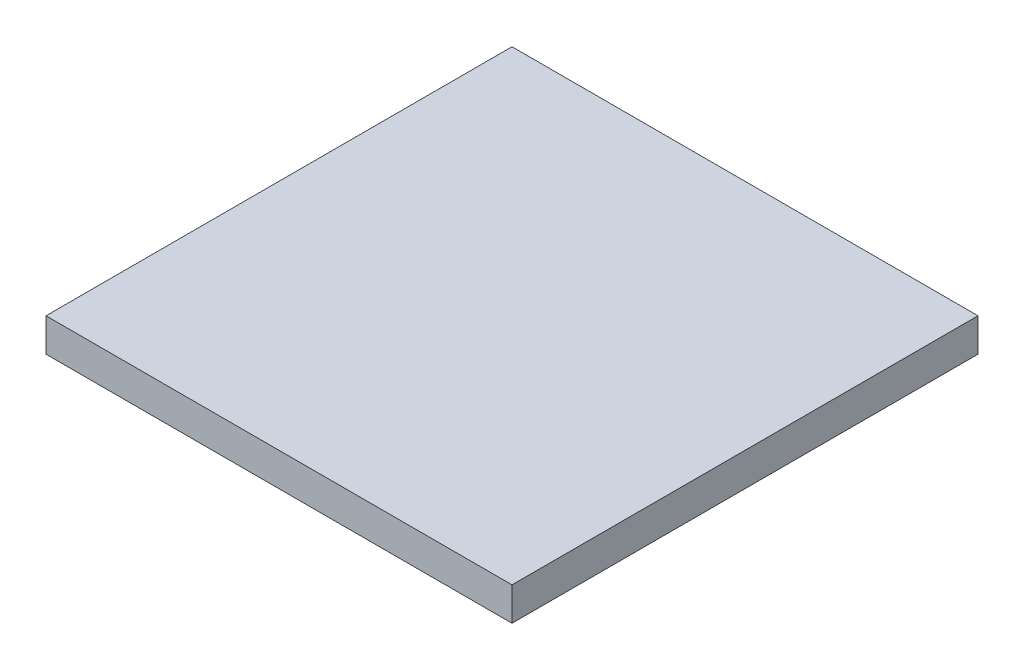
ISO-10303-21;
HEADER;
FILE_DESCRIPTION(('STEP AP214'),'2;1');
FILE_NAME('part.step','',(''),(''),'','','');
FILE_SCHEMA(('AUTOMOTIVE_DESIGN { 1 0 10303 214 1 1 1 1 }'));
ENDSEC;
DATA;
#1=APPLICATION_CONTEXT('core data for automotive mechanical design processes');
#2=APPLICATION_PROTOCOL_DEFINITION('international standard','automotive_design',2000,#1);
#3=PRODUCT_CONTEXT('',#1,'mechanical');
#4=PRODUCT('Part','Part','',(#3));
#5=PRODUCT_RELATED_PRODUCT_CATEGORY('part','',(#4));
#6=PRODUCT_DEFINITION_FORMATION('','',#4);
#7=PRODUCT_DEFINITION_CONTEXT('part definition',#1,'design');
#8=PRODUCT_DEFINITION('design','',#6,#7);
#9=PRODUCT_DEFINITION_SHAPE('','',#8);
#10=(LENGTH_UNIT() NAMED_UNIT(*) SI_UNIT(.MILLI.,.METRE.));
#11=(NAMED_UNIT(*) PLANE_ANGLE_UNIT() SI_UNIT($,.RADIAN.));
#12=(NAMED_UNIT(*) SI_UNIT($,.STERADIAN.) SOLID_ANGLE_UNIT());
#13=UNCERTAINTY_MEASURE_WITH_UNIT(LENGTH_MEASURE(1.E-05),#10,'distance_accuracy_value','');
#14=(GEOMETRIC_REPRESENTATION_CONTEXT(3) GLOBAL_UNCERTAINTY_ASSIGNED_CONTEXT((#13)) GLOBAL_UNIT_ASSIGNED_CONTEXT((#10,
#11,#12)) REPRESENTATION_CONTEXT('',''));
#15=CARTESIAN_POINT('',(0.,0.,0.));
#16=DIRECTION('',(0.,0.,1.));
#17=DIRECTION('',(1.,0.,0.));
#18=AXIS2_PLACEMENT_3D('',#15,#16,#17);
#19=CARTESIAN_POINT('',(0.,0.,0.));
#20=DIRECTION('',(0.,1.,0.));
#21=DIRECTION('',(0.,0.,1.));
#22=AXIS2_PLACEMENT_3D('',#19,#20,#21);
#23=PLANE('',#22);
#24=DIRECTION('',(0.,0.,1.));
#25=VECTOR('',#24,1.);
#26=CARTESIAN_POINT('',(-7.,0.,-7.));
#27=LINE('',#26,#25);
#28=CARTESIAN_POINT('',(-7.,0.,-7.));
#29=VERTEX_POINT('',#28);
#30=CARTESIAN_POINT('',(-7.,0.,7.));
#31=VERTEX_POINT('',#30);
#32=EDGE_CURVE('E79',#29,#31,#27,.T.);
#33=ORIENTED_EDGE('',*,*,#32,.F.);
#34=DIRECTION('',(-1.,0.,0.));
#35=VECTOR('',#34,1.);
#36=CARTESIAN_POINT('',(7.,0.,-7.));
#37=LINE('',#36,#35);
#38=CARTESIAN_POINT('',(7.,0.,-7.));
#39=VERTEX_POINT('',#38);
#40=EDGE_CURVE('E55',#39,#29,#37,.T.);
#41=ORIENTED_EDGE('',*,*,#40,.F.);
#42=DIRECTION('',(0.,0.,-1.));
#43=VECTOR('',#42,1.);
#44=CARTESIAN_POINT('',(7.,0.,7.));
#45=LINE('',#44,#43);
#46=CARTESIAN_POINT('',(7.,0.,7.));
#47=VERTEX_POINT('',#46);
#48=EDGE_CURVE('E57',#47,#39,#45,.T.);
#49=ORIENTED_EDGE('',*,*,#48,.F.);
#50=DIRECTION('',(1.,0.,0.));
#51=VECTOR('',#50,1.);
#52=CARTESIAN_POINT('',(-7.,0.,7.));
#53=LINE('',#52,#51);
#54=EDGE_CURVE('E20',#31,#47,#53,.T.);
#55=ORIENTED_EDGE('',*,*,#54,.F.);
#56=EDGE_LOOP('',(#33,#41,#49,#55));
#57=FACE_BOUND('',#56,.T.);
#58=ADVANCED_FACE('F17',(#57),#23,.F.);
#59=CARTESIAN_POINT('',(-7.,0.,7.));
#60=DIRECTION('',(0.,0.,1.));
#61=DIRECTION('',(1.,0.,0.));
#62=AXIS2_PLACEMENT_3D('',#59,#60,#61);
#63=PLANE('',#62);
#64=DIRECTION('',(1.,0.,0.));
#65=VECTOR('',#64,1.);
#66=CARTESIAN_POINT('',(0.,1.,7.));
#67=LINE('',#66,#65);
#68=CARTESIAN_POINT('',(-7.,1.,7.));
#69=VERTEX_POINT('',#68);
#70=CARTESIAN_POINT('',(7.,1.,7.));
#71=VERTEX_POINT('',#70);
#72=EDGE_CURVE('E83',#69,#71,#67,.T.);
#73=ORIENTED_EDGE('',*,*,#72,.F.);
#74=DIRECTION('',(0.,1.,0.));
#75=VECTOR('',#74,1.);
#76=CARTESIAN_POINT('',(-7.,0.,7.));
#77=LINE('',#76,#75);
#78=EDGE_CURVE('E68',#31,#69,#77,.T.);
#79=ORIENTED_EDGE('',*,*,#78,.F.);
#80=ORIENTED_EDGE('',*,*,#54,.T.);
#81=DIRECTION('',(0.,1.,0.));
#82=VECTOR('',#81,1.);
#83=CARTESIAN_POINT('',(7.,0.,7.));
#84=LINE('',#83,#82);
#85=EDGE_CURVE('E63',#71,#47,#84,.F.);
#86=ORIENTED_EDGE('',*,*,#85,.F.);
#87=EDGE_LOOP('',(#73,#79,#80,#86));
#88=FACE_BOUND('',#87,.T.);
#89=ADVANCED_FACE('F65',(#88),#63,.T.);
#90=CARTESIAN_POINT('',(7.,0.,7.));
#91=DIRECTION('',(1.,0.,0.));
#92=DIRECTION('',(0.,0.,-1.));
#93=AXIS2_PLACEMENT_3D('',#90,#91,#92);
#94=PLANE('',#93);
#95=DIRECTION('',(0.,0.,1.));
#96=VECTOR('',#95,1.);
#97=CARTESIAN_POINT('',(7.,1.,0.));
#98=LINE('',#97,#96);
#99=CARTESIAN_POINT('',(7.,1.,-7.));
#100=VERTEX_POINT('',#99);
#101=EDGE_CURVE('E72',#71,#100,#98,.F.);
#102=ORIENTED_EDGE('',*,*,#101,.F.);
#103=ORIENTED_EDGE('',*,*,#85,.T.);
#104=ORIENTED_EDGE('',*,*,#48,.T.);
#105=DIRECTION('',(0.,1.,0.));
#106=VECTOR('',#105,1.);
#107=CARTESIAN_POINT('',(7.,0.,-7.));
#108=LINE('',#107,#106);
#109=EDGE_CURVE('E75',#100,#39,#108,.F.);
#110=ORIENTED_EDGE('',*,*,#109,.F.);
#111=EDGE_LOOP('',(#102,#103,#104,#110));
#112=FACE_BOUND('',#111,.T.);
#113=ADVANCED_FACE('F70',(#112),#94,.T.);
#114=CARTESIAN_POINT('',(7.,0.,-7.));
#115=DIRECTION('',(0.,0.,-1.));
#116=DIRECTION('',(-1.,0.,0.));
#117=AXIS2_PLACEMENT_3D('',#114,#115,#116);
#118=PLANE('',#117);
#119=DIRECTION('',(1.,0.,0.));
#120=VECTOR('',#119,1.);
#121=CARTESIAN_POINT('',(0.,1.,-7.));
#122=LINE('',#121,#120);
#123=CARTESIAN_POINT('',(-7.,1.,-7.));
#124=VERTEX_POINT('',#123);
#125=EDGE_CURVE('E26',#100,#124,#122,.F.);
#126=ORIENTED_EDGE('',*,*,#125,.F.);
#127=ORIENTED_EDGE('',*,*,#109,.T.);
#128=ORIENTED_EDGE('',*,*,#40,.T.);
#129=DIRECTION('',(0.,1.,0.));
#130=VECTOR('',#129,1.);
#131=CARTESIAN_POINT('',(-7.,0.,-7.));
#132=LINE('',#131,#130);
#133=EDGE_CURVE('E35',#124,#29,#132,.F.);
#134=ORIENTED_EDGE('',*,*,#133,.F.);
#135=EDGE_LOOP('',(#126,#127,#128,#134));
#136=FACE_BOUND('',#135,.T.);
#137=ADVANCED_FACE('F89',(#136),#118,.T.);
#138=CARTESIAN_POINT('',(-7.,0.,-7.));
#139=DIRECTION('',(-1.,0.,0.));
#140=DIRECTION('',(0.,0.,1.));
#141=AXIS2_PLACEMENT_3D('',#138,#139,#140);
#142=PLANE('',#141);
#143=DIRECTION('',(0.,0.,1.));
#144=VECTOR('',#143,1.);
#145=CARTESIAN_POINT('',(-7.,1.,0.));
#146=LINE('',#145,#144);
#147=EDGE_CURVE('E11',#124,#69,#146,.T.);
#148=ORIENTED_EDGE('',*,*,#147,.F.);
#149=ORIENTED_EDGE('',*,*,#133,.T.);
#150=ORIENTED_EDGE('',*,*,#32,.T.);
#151=ORIENTED_EDGE('',*,*,#78,.T.);
#152=EDGE_LOOP('',(#148,#149,#150,#151));
#153=FACE_BOUND('',#152,.T.);
#154=ADVANCED_FACE('F91',(#153),#142,.T.);
#155=CARTESIAN_POINT('',(0.,1.,0.));
#156=DIRECTION('',(0.,1.,0.));
#157=DIRECTION('',(0.,0.,1.));
#158=AXIS2_PLACEMENT_3D('',#155,#156,#157);
#159=PLANE('',#158);
#160=ORIENTED_EDGE('',*,*,#125,.T.);
#161=ORIENTED_EDGE('',*,*,#147,.T.);
#162=ORIENTED_EDGE('',*,*,#72,.T.);
#163=ORIENTED_EDGE('',*,*,#101,.T.);
#164=EDGE_LOOP('',(#160,#161,#162,#163));
#165=FACE_BOUND('',#164,.T.);
#166=ADVANCED_FACE('F88',(#165),#159,.T.);
#167=CLOSED_SHELL('',(#58,#89,#113,#137,#154,#166));
#168=MANIFOLD_SOLID_BREP('B1',#167);
#169=ADVANCED_BREP_SHAPE_REPRESENTATION('',(#18,#168),#14);
#170=SHAPE_DEFINITION_REPRESENTATION(#9,#169);
ENDSEC;
END-ISO-10303-21;
